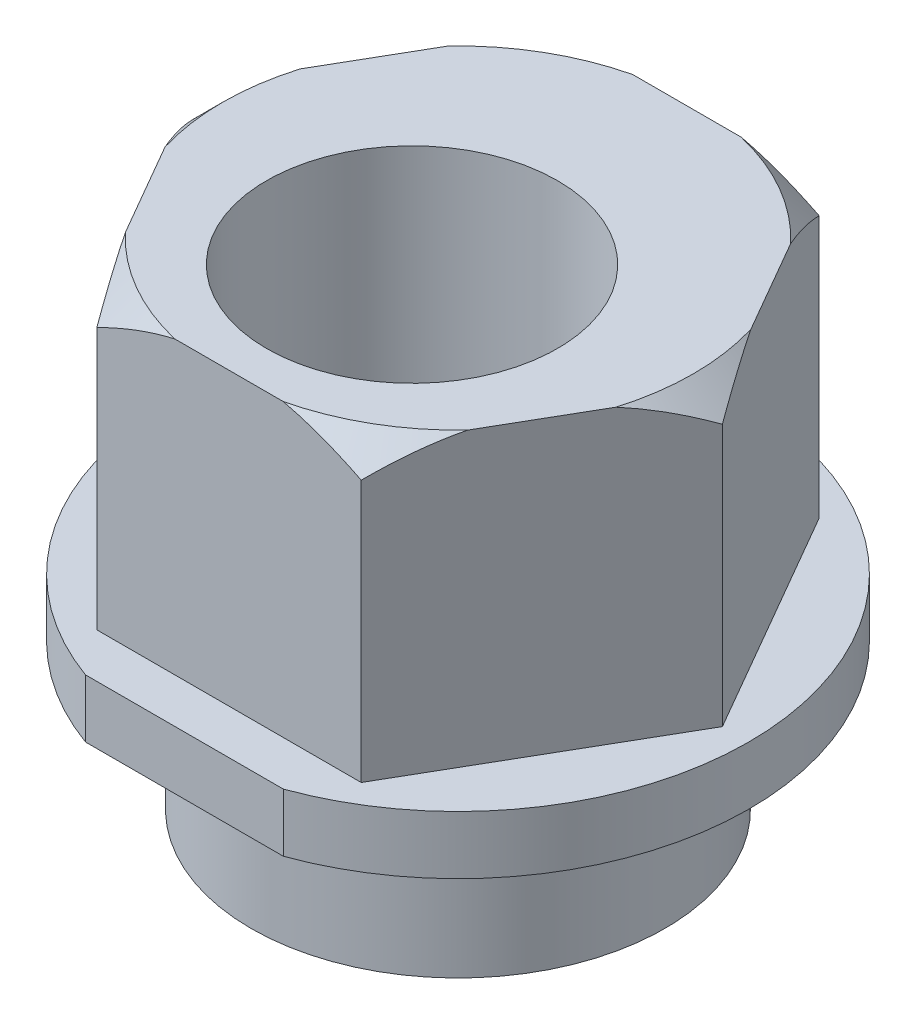
ISO-10303-21;
HEADER;
FILE_DESCRIPTION(('STEP AP214'),'2;1');
FILE_NAME('part.step','',(''),(''),'','','');
FILE_SCHEMA(('AUTOMOTIVE_DESIGN { 1 0 10303 214 1 1 1 1 }'));
ENDSEC;
DATA;
#1=APPLICATION_CONTEXT('core data for automotive mechanical design processes');
#2=APPLICATION_PROTOCOL_DEFINITION('international standard','automotive_design',2000,#1);
#3=PRODUCT_CONTEXT('',#1,'mechanical');
#4=PRODUCT('Part','Part','',(#3));
#5=PRODUCT_RELATED_PRODUCT_CATEGORY('part','',(#4));
#6=PRODUCT_DEFINITION_FORMATION('','',#4);
#7=PRODUCT_DEFINITION_CONTEXT('part definition',#1,'design');
#8=PRODUCT_DEFINITION('design','',#6,#7);
#9=PRODUCT_DEFINITION_SHAPE('','',#8);
#10=(LENGTH_UNIT() NAMED_UNIT(*) SI_UNIT(.MILLI.,.METRE.));
#11=(NAMED_UNIT(*) PLANE_ANGLE_UNIT() SI_UNIT($,.RADIAN.));
#12=(NAMED_UNIT(*) SI_UNIT($,.STERADIAN.) SOLID_ANGLE_UNIT());
#13=UNCERTAINTY_MEASURE_WITH_UNIT(LENGTH_MEASURE(1.E-05),#10,'distance_accuracy_value','');
#14=(GEOMETRIC_REPRESENTATION_CONTEXT(3) GLOBAL_UNCERTAINTY_ASSIGNED_CONTEXT((#13)) GLOBAL_UNIT_ASSIGNED_CONTEXT((#10,
#11,#12)) REPRESENTATION_CONTEXT('',''));
#15=CARTESIAN_POINT('',(0.,0.,0.));
#16=DIRECTION('',(0.,0.,1.));
#17=DIRECTION('',(1.,0.,0.));
#18=AXIS2_PLACEMENT_3D('',#15,#16,#17);
#19=CARTESIAN_POINT('',(0.,-1.,0.));
#20=DIRECTION('',(0.,1.,0.));
#21=DIRECTION('',(0.,0.,1.));
#22=AXIS2_PLACEMENT_3D('',#19,#20,#21);
#23=PLANE('',#22);
#24=CARTESIAN_POINT('',(0.,-1.,0.));
#25=DIRECTION('',(0.,1.,0.));
#26=DIRECTION('',(0.,0.,1.));
#27=AXIS2_PLACEMENT_3D('',#24,#25,#26);
#28=CIRCLE('',#27,5.);
#29=CARTESIAN_POINT('',(1.7,-1.,4.7021271782035));
#30=VERTEX_POINT('',#29);
#31=CARTESIAN_POINT('',(-1.7,-1.,4.7021271782035));
#32=VERTEX_POINT('',#31);
#33=EDGE_CURVE('E233',#30,#32,#28,.T.);
#34=ORIENTED_EDGE('',*,*,#33,.F.);
#35=DIRECTION('',(-1.,0.,0.));
#36=VECTOR('',#35,1.);
#37=CARTESIAN_POINT('',(0.,-1.,4.7021271782035));
#38=LINE('',#37,#36);
#39=EDGE_CURVE('E348',#30,#32,#38,.T.);
#40=ORIENTED_EDGE('',*,*,#39,.T.);
#41=EDGE_LOOP('',(#34,#40));
#42=FACE_BOUND('',#41,.T.);
#43=CARTESIAN_POINT('',(0.,-1.,0.));
#44=DIRECTION('',(0.,1.,0.));
#45=DIRECTION('',(0.,0.,1.));
#46=AXIS2_PLACEMENT_3D('',#43,#44,#45);
#47=CIRCLE('',#46,3.555);
#48=CARTESIAN_POINT('',(0.,-1.,3.555));
#49=VERTEX_POINT('',#48);
#50=EDGE_CURVE('E178',#49,#49,#47,.F.);
#51=ORIENTED_EDGE('',*,*,#50,.F.);
#52=EDGE_LOOP('',(#51));
#53=FACE_BOUND('',#52,.T.);
#54=ADVANCED_FACE('F46',(#42,#53),#23,.F.);
#55=CARTESIAN_POINT('',(2.27187330926118,5.,3.935));
#56=DIRECTION('',(-0.866025403784439,0.,-0.5));
#57=DIRECTION('',(-0.5,0.,0.866025403784439));
#58=AXIS2_PLACEMENT_3D('',#55,#56,#57);
#59=PLANE('',#58);
#60=DIRECTION('',(0.,-1.,0.));
#61=VECTOR('',#60,1.);
#62=CARTESIAN_POINT('',(4.54374661852235,5.,0.));
#63=LINE('',#62,#61);
#64=CARTESIAN_POINT('',(4.54374661852235,4.5,0.));
#65=VERTEX_POINT('',#64);
#66=CARTESIAN_POINT('',(4.54374661852235,0.,0.));
#67=VERTEX_POINT('',#66);
#68=EDGE_CURVE('E175',#65,#67,#63,.T.);
#69=ORIENTED_EDGE('',*,*,#68,.F.);
#70=CARTESIAN_POINT('',(6.12736327266163,2.33046829888115,-2.74290450468147));
#71=CARTESIAN_POINT('',(6.07348339276709,2.4177650828994,-2.64958181519841));
#72=CARTESIAN_POINT('',(6.01938921555573,2.50453762285222,-2.55588795187471));
#73=CARTESIAN_POINT('',(5.91069789973588,2.67683309661582,-2.36762907053321));
#74=CARTESIAN_POINT('',(5.85610071578471,2.76235591593962,-2.27306397397959));
#75=CARTESIAN_POINT('',(5.74620735938589,2.9321379387506,-2.08272309728255));
#76=CARTESIAN_POINT('',(5.6909098259844,3.01639362513631,-1.98694495989795));
#77=CARTESIAN_POINT('',(5.57966030231228,3.18315508159383,-1.79425513258));
#78=CARTESIAN_POINT('',(5.52370832991605,3.26566089928668,-1.69734347360602));
#79=CARTESIAN_POINT('',(5.40948255505868,3.43085092459455,-1.49949862801914));
#80=CARTESIAN_POINT('',(5.3511874452437,3.51347634106705,-1.3985285359868));
#81=CARTESIAN_POINT('',(5.23367321649109,3.67605365317037,-1.194987921175));
#82=CARTESIAN_POINT('',(5.17445413325307,3.75600565172091,-1.09241746022911));
#83=CARTESIAN_POINT('',(5.05499257757878,3.9125743398257,-0.885503976250002));
#84=CARTESIAN_POINT('',(4.99475102957391,3.98919384008597,-0.78116255437897));
#85=CARTESIAN_POINT('',(4.873034492307,4.1383918042904,-0.570343327711337));
#86=CARTESIAN_POINT('',(4.81155966257741,4.21097078637303,-0.463865799233039));
#87=CARTESIAN_POINT('',(4.68581480841085,4.35265115676022,-0.246069323026223));
#88=CARTESIAN_POINT('',(4.62151303943029,4.42164059850529,-0.134695392135335));
#89=CARTESIAN_POINT('',(4.4912183922476,4.55301635986169,0.090981556739347));
#90=CARTESIAN_POINT('',(4.42522527529575,4.61540174079966,0.205284988249787));
#91=CARTESIAN_POINT('',(4.29176890522431,4.73150823576122,0.436438201807242));
#92=CARTESIAN_POINT('',(4.22431561588303,4.78527468558276,0.553270726083977));
#93=CARTESIAN_POINT('',(4.08756303909753,4.88247623364584,0.790133137142428));
#94=CARTESIAN_POINT('',(4.01826431274338,4.92591443311341,0.910162052087628));
#95=CARTESIAN_POINT('',(3.89160680975576,4.99299560676046,1.129539282422));
#96=CARTESIAN_POINT('',(3.83454175212893,5.01884439579798,1.22837886156851));
#97=CARTESIAN_POINT('',(3.71955042243969,5.06126068823275,1.42754968702018));
#98=CARTESIAN_POINT('',(3.66162427680432,5.0778295405829,1.52788071434728));
#99=CARTESIAN_POINT('',(3.54536540774452,5.10083438466152,1.72924698238935));
#100=CARTESIAN_POINT('',(3.4870335640049,5.1072879053957,1.83028069944554));
#101=CARTESIAN_POINT('',(3.37031281221754,5.10976287991731,2.03244697183888));
#102=CARTESIAN_POINT('',(3.31192390350574,5.10578421082689,2.13357952832621));
#103=CARTESIAN_POINT('',(3.19571069696838,5.08764038060559,2.33486670655941));
#104=CARTESIAN_POINT('',(3.13788528988516,5.07350318473267,2.43502324959591));
#105=CARTESIAN_POINT('',(3.02300572590152,5.03579603444199,2.63400049116693));
#106=CARTESIAN_POINT('',(2.96595175572664,5.01222383709666,2.73282086628335));
#107=CARTESIAN_POINT('',(2.85271904802042,4.95661618256865,2.9289456691091));
#108=CARTESIAN_POINT('',(2.79654337792266,4.92455603960202,3.02624478386765));
#109=CARTESIAN_POINT('',(2.68537248742994,4.85318593152667,3.21879841452373));
#110=CARTESIAN_POINT('',(2.63037720983353,4.81387631861451,3.31405302949706));
#111=CARTESIAN_POINT('',(2.5019161833033,4.71383121159169,3.53655405423988));
#112=CARTESIAN_POINT('',(2.42896022795634,4.65048731772351,3.66291747561553));
#113=CARTESIAN_POINT('',(2.28511505424096,4.51496245516658,3.91206462491415));
#114=CARTESIAN_POINT('',(2.2142269607044,4.44277678394606,4.03484640457117));
#115=CARTESIAN_POINT('',(2.07416708594693,4.29140781010891,4.27743722375284));
#116=CARTESIAN_POINT('',(2.00499919286836,4.21221022636325,4.39723952881742));
#117=CARTESIAN_POINT('',(1.86828970424628,4.04847541244671,4.63402730898762));
#118=CARTESIAN_POINT('',(1.80074782327538,3.96393912900212,4.75101327846797));
#119=CARTESIAN_POINT('',(1.6667324101583,3.790255628053,4.9831347829841));
#120=CARTESIAN_POINT('',(1.60026513983173,3.70108917509827,5.09825947223014));
#121=CARTESIAN_POINT('',(1.46849790545969,3.51936003005431,5.32648701693534));
#122=CARTESIAN_POINT('',(1.40319803917282,3.42679705550268,5.43958970307165));
#123=CARTESIAN_POINT('',(1.27366225353528,3.23904020589262,5.66395226519422));
#124=CARTESIAN_POINT('',(1.20942525212282,3.14384930831284,5.77521401536649));
#125=CARTESIAN_POINT('',(1.08179181966025,2.9512386314917,5.99628160513605));
#126=CARTESIAN_POINT('',(1.01839540535985,2.85381880794148,6.10608741572204));
#127=CARTESIAN_POINT('',(0.910409016945997,2.6853578347565,6.2931253269807));
#128=CARTESIAN_POINT('',(0.865642352807006,2.61476846228915,6.3706634637548));
#129=CARTESIAN_POINT('',(0.776622094234247,2.47305833440251,6.52485107450574));
#130=CARTESIAN_POINT('',(0.732367142810404,2.40194099006958,6.60150289885833));
#131=CARTESIAN_POINT('',(0.688256655121896,2.33046829888115,6.67790450468147));
#132=B_SPLINE_CURVE_WITH_KNOTS('',3,(#70,#71,#72,#73,#74,#75,#76,#77,#78,#79,#80,#81,#82,#83,
#84,#85,#86,#87,#88,#89,#90,#91,#92,#93,#94,#95,#96,#97,#98,#99,#100,#101,#102,#103,#104,#105,
#106,#107,#108,#109,#110,#111,#112,#113,#114,#115,#116,#117,#118,#119,#120,#121,#122,#123,#124,
#125,#126,#127,#128,#129,#130,#131),.UNSPECIFIED.,.F.,.F.,(4,2,2,2,2,2,2,2,2,2,2,2,2,2,2,2,2,2,
2,2,2,2,2,2,2,2,2,2,2,2,4),(0.,0.416050988652375,0.832139855784054,1.24922530063749,
1.6662993802975,2.09496685038955,2.52361779884089,2.95189991005181,3.38012697311563,
3.81779500231414,4.25552515650994,4.69087140580247,5.12608676971888,5.4768138337239,
5.82748990199696,6.17755760407587,6.52762942952254,6.87674122143841,7.22593605499141,
7.5761578380004,7.92636261087879,8.40316579002672,8.88022366888807,9.35827656071276,
9.83624491486482,10.316388748245,10.7965726023688,11.2762330860941,11.7559031133002,
12.0979389750605,12.4385584137849),.UNSPECIFIED.);
#133=CARTESIAN_POINT('',(3.87355176865353,5.,1.1608115309438));
#134=VERTEX_POINT('',#133);
#135=EDGE_CURVE('E325',#65,#134,#132,.T.);
#136=ORIENTED_EDGE('',*,*,#135,.T.);
#137=DIRECTION('',(0.5,0.,-0.866025403784439));
#138=VECTOR('',#137,1.);
#139=CARTESIAN_POINT('',(2.27187330926118,5.,3.935));
#140=LINE('',#139,#138);
#141=CARTESIAN_POINT('',(2.94206815913,5.,2.7741884690562));
#142=VERTEX_POINT('',#141);
#143=EDGE_CURVE('E245',#142,#134,#140,.T.);
#144=ORIENTED_EDGE('',*,*,#143,.F.);
#145=CARTESIAN_POINT('',(2.27187330926118,4.5,3.935));
#146=VERTEX_POINT('',#145);
#147=EDGE_CURVE('E262',#142,#146,#132,.T.);
#148=ORIENTED_EDGE('',*,*,#147,.T.);
#149=DIRECTION('',(0.,-1.,0.));
#150=VECTOR('',#149,1.);
#151=CARTESIAN_POINT('',(2.27187330926118,5.,3.935));
#152=LINE('',#151,#150);
#153=CARTESIAN_POINT('',(2.27187330926118,0.,3.935));
#154=VERTEX_POINT('',#153);
#155=EDGE_CURVE('E229',#146,#154,#152,.T.);
#156=ORIENTED_EDGE('',*,*,#155,.T.);
#157=DIRECTION('',(0.5,0.,-0.866025403784439));
#158=VECTOR('',#157,1.);
#159=CARTESIAN_POINT('',(2.27187330926118,0.,3.935));
#160=LINE('',#159,#158);
#161=EDGE_CURVE('E230',#154,#67,#160,.T.);
#162=ORIENTED_EDGE('',*,*,#161,.T.);
#163=EDGE_LOOP('',(#69,#136,#144,#148,#156,#162));
#164=FACE_BOUND('',#163,.T.);
#165=ADVANCED_FACE('F48',(#164),#59,.F.);
#166=CARTESIAN_POINT('',(4.54374661852235,5.,0.));
#167=DIRECTION('',(-0.866025403784438,0.,0.5));
#168=DIRECTION('',(0.5,0.,0.866025403784438));
#169=AXIS2_PLACEMENT_3D('',#166,#167,#168);
#170=PLANE('',#169);
#171=DIRECTION('',(0.,-1.,0.));
#172=VECTOR('',#171,1.);
#173=CARTESIAN_POINT('',(2.27187330926118,5.,-3.935));
#174=LINE('',#173,#172);
#175=CARTESIAN_POINT('',(2.27187330926118,4.5,-3.935));
#176=VERTEX_POINT('',#175);
#177=CARTESIAN_POINT('',(2.27187330926118,0.,-3.935));
#178=VERTEX_POINT('',#177);
#179=EDGE_CURVE('E164',#176,#178,#174,.T.);
#180=ORIENTED_EDGE('',*,*,#179,.F.);
#181=CARTESIAN_POINT('',(0.688256655121894,2.33046829888116,-6.67790450468146));
#182=CARTESIAN_POINT('',(0.742136535016436,2.4177650828994,-6.58458181519841));
#183=CARTESIAN_POINT('',(0.796230712227795,2.50453762285222,-6.4908879518747));
#184=CARTESIAN_POINT('',(0.904922028047648,2.67683309661582,-6.3026290705332));
#185=CARTESIAN_POINT('',(0.959519211998818,2.76235591593963,-6.20806397397959));
#186=CARTESIAN_POINT('',(1.06941256839764,2.93213793875061,-6.01772309728255));
#187=CARTESIAN_POINT('',(1.12471010179913,3.01639362513632,-5.92194495989794));
#188=CARTESIAN_POINT('',(1.23595962547125,3.18315508159383,-5.72925513257999));
#189=CARTESIAN_POINT('',(1.29191159786749,3.26566089928668,-5.63234347360602));
#190=CARTESIAN_POINT('',(1.40613737272485,3.43085092459456,-5.43449862801913));
#191=CARTESIAN_POINT('',(1.46443248253983,3.51347634106706,-5.33352853598679));
#192=CARTESIAN_POINT('',(1.58194671129244,3.67605365317038,-5.12998792117499));
#193=CARTESIAN_POINT('',(1.64116579453046,3.75600565172092,-5.0274174602291));
#194=CARTESIAN_POINT('',(1.76062735020476,3.9125743398257,-4.82050397624999));
#195=CARTESIAN_POINT('',(1.82086889820963,3.98919384008598,-4.71616255437896));
#196=CARTESIAN_POINT('',(1.94258543547653,4.1383918042904,-4.50534332771133));
#197=CARTESIAN_POINT('',(2.00406026520612,4.21097078637303,-4.39886579923303));
#198=CARTESIAN_POINT('',(2.12980511937268,4.35265115676022,-4.18106932302621));
#199=CARTESIAN_POINT('',(2.19410688835324,4.4216405985053,-4.06969539213533));
#200=CARTESIAN_POINT('',(2.32440153553593,4.5530163598617,-3.84401844326064));
#201=CARTESIAN_POINT('',(2.39039465248778,4.61540174079966,-3.7297150117502));
#202=CARTESIAN_POINT('',(2.52385102255923,4.73150823576123,-3.49856179819275));
#203=CARTESIAN_POINT('',(2.5913043119005,4.78527468558276,-3.38172927391602));
#204=CARTESIAN_POINT('',(2.728056888686,4.88247623364584,-3.14486686285757));
#205=CARTESIAN_POINT('',(2.79735561504015,4.92591443311342,-3.02483794791237));
#206=CARTESIAN_POINT('',(2.92401311802778,4.99299560676046,-2.805460717578));
#207=CARTESIAN_POINT('',(2.98107817565461,5.01884439579799,-2.70662113843148));
#208=CARTESIAN_POINT('',(3.09606950534385,5.06126068823276,-2.50745031297981));
#209=CARTESIAN_POINT('',(3.15399565097922,5.0778295405829,-2.40711928565272));
#210=CARTESIAN_POINT('',(3.27025452003902,5.10083438466152,-2.20575301761065));
#211=CARTESIAN_POINT('',(3.32858636377864,5.1072879053957,-2.10471930055446));
#212=CARTESIAN_POINT('',(3.445307115566,5.10976287991731,-1.90255302816112));
#213=CARTESIAN_POINT('',(3.50369602427779,5.10578421082689,-1.80142047167379));
#214=CARTESIAN_POINT('',(3.61990923081515,5.08764038060559,-1.60013329344058));
#215=CARTESIAN_POINT('',(3.67773463789837,5.07350318473267,-1.49997675040409));
#216=CARTESIAN_POINT('',(3.79261420188202,5.03579603444199,-1.30099950883306));
#217=CARTESIAN_POINT('',(3.8496681720569,5.01222383709666,-1.20217913371665));
#218=CARTESIAN_POINT('',(3.96290087976311,4.95661618256865,-1.00605433089089));
#219=CARTESIAN_POINT('',(4.01907654986087,4.92455603960202,-0.908755216132345));
#220=CARTESIAN_POINT('',(4.13024744035359,4.85318593152667,-0.716201585476272));
#221=CARTESIAN_POINT('',(4.18524271795,4.81387631861451,-0.620946970502936));
#222=CARTESIAN_POINT('',(4.31370374448024,4.71383121159169,-0.398445945760117));
#223=CARTESIAN_POINT('',(4.38665969982719,4.6504873177235,-0.272082524384468));
#224=CARTESIAN_POINT('',(4.53050487354258,4.51496245516658,-0.0229353750858439));
#225=CARTESIAN_POINT('',(4.60139296707914,4.44277678394605,0.0998464045711766));
#226=CARTESIAN_POINT('',(4.74145284183661,4.2914078101089,0.342437223752842));
#227=CARTESIAN_POINT('',(4.81062073491518,4.21221022636324,0.462239528817422));
#228=CARTESIAN_POINT('',(4.94733022353726,4.0484754124467,0.699027308987622));
#229=CARTESIAN_POINT('',(5.01487210450815,3.96393912900211,0.81601327846798));
#230=CARTESIAN_POINT('',(5.14888751762524,3.79025562805299,1.04813478298411));
#231=CARTESIAN_POINT('',(5.21535478795181,3.70108917509827,1.16325947223014));
#232=CARTESIAN_POINT('',(5.34712202232385,3.5193600300543,1.39148701693534));
#233=CARTESIAN_POINT('',(5.41242188861072,3.42679705550267,1.50458970307166));
#234=CARTESIAN_POINT('',(5.54195767424825,3.23904020589262,1.72895226519422));
#235=CARTESIAN_POINT('',(5.60619467566072,3.14384930831283,1.84021401536649));
#236=CARTESIAN_POINT('',(5.73382810812329,2.95123863149169,2.06128160513606));
#237=CARTESIAN_POINT('',(5.79722452242369,2.85381880794147,2.17108741572204));
#238=CARTESIAN_POINT('',(5.90521091083754,2.68535783475649,2.3581253269807));
#239=CARTESIAN_POINT('',(5.94997757497653,2.61476846228915,2.43566346375481));
#240=CARTESIAN_POINT('',(6.03899783354929,2.47305833440251,2.58985107450574));
#241=CARTESIAN_POINT('',(6.08325278497313,2.40194099006958,2.66650289885833));
#242=CARTESIAN_POINT('',(6.12736327266164,2.33046829888115,2.74290450468146));
#243=B_SPLINE_CURVE_WITH_KNOTS('',3,(#181,#182,#183,#184,#185,#186,#187,#188,#189,#190,#191,
#192,#193,#194,#195,#196,#197,#198,#199,#200,#201,#202,#203,#204,#205,#206,#207,#208,#209,#210,
#211,#212,#213,#214,#215,#216,#217,#218,#219,#220,#221,#222,#223,#224,#225,#226,#227,#228,#229,
#230,#231,#232,#233,#234,#235,#236,#237,#238,#239,#240,#241,#242),.UNSPECIFIED.,.F.,.F.,(4,2,2,
2,2,2,2,2,2,2,2,2,2,2,2,2,2,2,2,2,2,2,2,2,2,2,2,2,2,2,4),(0.,0.416050988652376,
0.832139855784055,1.24922530063749,1.66629938029751,2.09496685038956,2.5236177988409,
2.95189991005182,3.38012697311563,3.81779500231415,4.25552515650994,4.69087140580247,
5.12608676971889,5.4768138337239,5.82748990199696,6.17755760407587,6.52762942952254,
6.87674122143841,7.22593605499141,7.57615783800039,7.92636261087879,8.40316579002672,
8.88022366888807,9.35827656071276,9.83624491486482,10.316388748245,10.7965726023688,
11.2762330860941,11.7559031133002,12.0979389750605,12.4385584137849),.UNSPECIFIED.);
#244=CARTESIAN_POINT('',(2.94206815913,5.,-2.7741884690562));
#245=VERTEX_POINT('',#244);
#246=EDGE_CURVE('E147',#176,#245,#243,.T.);
#247=ORIENTED_EDGE('',*,*,#246,.T.);
#248=DIRECTION('',(-0.5,0.,-0.866025403784438));
#249=VECTOR('',#248,1.);
#250=CARTESIAN_POINT('',(4.54374661852235,5.,0.));
#251=LINE('',#250,#249);
#252=CARTESIAN_POINT('',(3.87355176865353,5.,-1.1608115309438));
#253=VERTEX_POINT('',#252);
#254=EDGE_CURVE('E223',#253,#245,#251,.T.);
#255=ORIENTED_EDGE('',*,*,#254,.F.);
#256=EDGE_CURVE('E157',#253,#65,#243,.T.);
#257=ORIENTED_EDGE('',*,*,#256,.T.);
#258=ORIENTED_EDGE('',*,*,#68,.T.);
#259=DIRECTION('',(-0.5,0.,-0.866025403784438));
#260=VECTOR('',#259,1.);
#261=CARTESIAN_POINT('',(4.54374661852235,0.,0.));
#262=LINE('',#261,#260);
#263=EDGE_CURVE('E174',#67,#178,#262,.T.);
#264=ORIENTED_EDGE('',*,*,#263,.T.);
#265=EDGE_LOOP('',(#180,#247,#255,#257,#258,#264));
#266=FACE_BOUND('',#265,.T.);
#267=ADVANCED_FACE('F172',(#266),#170,.F.);
#268=CARTESIAN_POINT('',(2.27187330926118,5.,-3.935));
#269=DIRECTION('',(0.,0.,1.));
#270=DIRECTION('',(1.,0.,0.));
#271=AXIS2_PLACEMENT_3D('',#268,#269,#270);
#272=PLANE('',#271);
#273=DIRECTION('',(0.,-1.,0.));
#274=VECTOR('',#273,1.);
#275=CARTESIAN_POINT('',(-2.27187330926118,5.,-3.935));
#276=LINE('',#275,#274);
#277=CARTESIAN_POINT('',(-2.27187330926118,4.5,-3.935));
#278=VERTEX_POINT('',#277);
#279=CARTESIAN_POINT('',(-2.27187330926118,0.,-3.935));
#280=VERTEX_POINT('',#279);
#281=EDGE_CURVE('E176',#278,#280,#276,.T.);
#282=ORIENTED_EDGE('',*,*,#281,.F.);
#283=CARTESIAN_POINT('',(-5.01477781394264,2.6694057488158,-3.935));
#284=CARTESIAN_POINT('',(-4.90228240032233,2.75789162999437,-3.935));
#285=CARTESIAN_POINT('',(-4.78924605492269,2.84569863662638,-3.935));
#286=CARTESIAN_POINT('',(-4.56188241632701,3.01966288534844,-3.935));
#287=CARTESIAN_POINT('',(-4.44755491307628,3.10581985266844,-3.935));
#288=CARTESIAN_POINT('',(-4.21685222046402,3.27659538663721,-3.935));
#289=CARTESIAN_POINT('',(-4.10046957789372,3.36120391114583,-3.935));
#290=CARTESIAN_POINT('',(-3.86599418351296,3.52801066974508,-3.935));
#291=CARTESIAN_POINT('',(-3.74790151420127,3.61020901953759,-3.935));
#292=CARTESIAN_POINT('',(-3.50380543280417,3.77568927594522,-3.935));
#293=CARTESIAN_POINT('',(-3.3777005297054,3.85882204730453,-3.935));
#294=CARTESIAN_POINT('',(-3.12293409141574,4.0210686075328,-3.935));
#295=CARTESIAN_POINT('',(-2.99427277147477,4.10018273279293,-3.935));
#296=CARTESIAN_POINT('',(-2.7342134500717,4.25322326602883,-3.935));
#297=CARTESIAN_POINT('',(-2.60282112402671,4.32715926211431,-3.935));
#298=CARTESIAN_POINT('',(-2.33665993470769,4.46865096658867,-3.935));
#299=CARTESIAN_POINT('',(-2.20189200633557,4.53620841737975,-3.935));
#300=CARTESIAN_POINT('',(-1.94277039794665,4.65662539379787,-3.935));
#301=CARTESIAN_POINT('',(-1.81879024517606,4.7102827638368,-3.935));
#302=CARTESIAN_POINT('',(-1.56760322182998,4.80956431437058,-3.935));
#303=CARTESIAN_POINT('',(-1.4403960426367,4.8551877231961,-3.935));
#304=CARTESIAN_POINT('',(-1.18430895439847,4.93616339546024,-3.935));
#305=CARTESIAN_POINT('',(-1.05546474171029,4.97162701315895,-3.935));
#306=CARTESIAN_POINT('',(-0.795188728182397,5.03120060018271,-3.935));
#307=CARTESIAN_POINT('',(-0.663757985336443,5.05531511515621,-3.935));
#308=CARTESIAN_POINT('',(-0.39667530812576,5.09105643721047,-3.935));
#309=CARTESIAN_POINT('',(-0.260990364554486,5.10244193256667,-3.935));
#310=CARTESIAN_POINT('',(0.0108256286758382,5.11107629854814,-3.935));
#311=CARTESIAN_POINT('',(0.146956639108313,5.10832638056083,-3.935));
#312=CARTESIAN_POINT('',(0.418619878870053,5.08887050209526,-3.935));
#313=CARTESIAN_POINT('',(0.554148970208934,5.0721215602934,-3.935));
#314=CARTESIAN_POINT('',(0.822982454746628,5.02579152850102,-3.935));
#315=CARTESIAN_POINT('',(0.956286242224141,4.99620700199297,-3.935));
#316=CARTESIAN_POINT('',(1.26105655280132,4.91498323631563,-3.935));
#317=CARTESIAN_POINT('',(1.43144793684183,4.85934235740488,-3.935));
#318=CARTESIAN_POINT('',(1.76659971199313,4.73318715507506,-3.935));
#319=CARTESIAN_POINT('',(1.93135663408204,4.66266385383244,-3.935));
#320=CARTESIAN_POINT('',(2.25670464302017,4.50985567629177,-3.935));
#321=CARTESIAN_POINT('',(2.41725700907644,4.42748946751823,-3.935));
#322=CARTESIAN_POINT('',(2.7335996666453,4.25424890954647,-3.935));
#323=CARTESIAN_POINT('',(2.88939106725242,4.16337656225559,-3.935));
#324=CARTESIAN_POINT('',(3.2171018287942,3.96289685347115,-3.935));
#325=CARTESIAN_POINT('',(3.38846902004868,3.85239290462363,-3.935));
#326=CARTESIAN_POINT('',(3.7271209143155,3.62526903861077,-3.935));
#327=CARTESIAN_POINT('',(3.89440474117752,3.50864782550207,-3.935));
#328=CARTESIAN_POINT('',(4.22200861608271,3.27340163426143,-3.935));
#329=CARTESIAN_POINT('',(4.38240091884256,3.15487687320021,-3.935));
#330=CARTESIAN_POINT('',(4.6209837589724,2.97456068361506,-3.935));
#331=CARTESIAN_POINT('',(4.70015123515769,2.91405422097405,-3.935));
#332=CARTESIAN_POINT('',(4.85789331048121,2.79227931530866,-3.935));
#333=CARTESIAN_POINT('',(4.93646793238964,2.73101090179094,-3.935));
#334=CARTESIAN_POINT('',(5.01477781394264,2.6694057488158,-3.935));
#335=B_SPLINE_CURVE_WITH_KNOTS('',3,(#283,#284,#285,#286,#287,#288,#289,#290,#291,#292,#293,
#294,#295,#296,#297,#298,#299,#300,#301,#302,#303,#304,#305,#306,#307,#308,#309,#310,#311,#312,
#313,#314,#315,#316,#317,#318,#319,#320,#321,#322,#323,#324,#325,#326,#327,#328,#329,#330,#331,
#332,#333,#334),.UNSPECIFIED.,.F.,.F.,(4,2,2,2,2,2,2,2,2,2,2,2,2,2,2,2,2,2,2,2,2,2,2,2,2,4),(0.,
0.429382623340998,0.858836137877717,1.29047192805164,1.72208696325132,2.17515026344406,
2.62817557609088,3.08033856015113,3.53237766908385,3.9374314291705,4.34252407384557,
4.74299021725164,5.14329582542998,5.55106798246257,5.95880519450876,6.36779890408527,
6.77690218266532,7.31369645202257,7.85081547305105,8.39181700182992,8.932691525285,
9.54423171138721,10.15590197977,10.7541421331558,11.0530644250241,11.35197517691),.UNSPECIFIED.);
#336=CARTESIAN_POINT('',(-0.931483609523527,5.,-3.935));
#337=VERTEX_POINT('',#336);
#338=EDGE_CURVE('E169',#278,#337,#335,.T.);
#339=ORIENTED_EDGE('',*,*,#338,.T.);
#340=DIRECTION('',(-1.,0.,0.));
#341=VECTOR('',#340,1.);
#342=CARTESIAN_POINT('',(2.27187330926118,5.,-3.935));
#343=LINE('',#342,#341);
#344=CARTESIAN_POINT('',(0.931483609523526,5.,-3.935));
#345=VERTEX_POINT('',#344);
#346=EDGE_CURVE('E168',#345,#337,#343,.T.);
#347=ORIENTED_EDGE('',*,*,#346,.F.);
#348=EDGE_CURVE('E150',#345,#176,#335,.T.);
#349=ORIENTED_EDGE('',*,*,#348,.T.);
#350=ORIENTED_EDGE('',*,*,#179,.T.);
#351=DIRECTION('',(-1.,0.,0.));
#352=VECTOR('',#351,1.);
#353=CARTESIAN_POINT('',(2.27187330926118,0.,-3.935));
#354=LINE('',#353,#352);
#355=EDGE_CURVE('E235',#178,#280,#354,.T.);
#356=ORIENTED_EDGE('',*,*,#355,.T.);
#357=EDGE_LOOP('',(#282,#339,#347,#349,#350,#356));
#358=FACE_BOUND('',#357,.T.);
#359=ADVANCED_FACE('F162',(#358),#272,.F.);
#360=CARTESIAN_POINT('',(-2.27187330926118,5.,-3.935));
#361=DIRECTION('',(0.866025403784438,0.,0.5));
#362=DIRECTION('',(0.5,0.,-0.866025403784439));
#363=AXIS2_PLACEMENT_3D('',#360,#361,#362);
#364=PLANE('',#363);
#365=DIRECTION('',(0.,-1.,0.));
#366=VECTOR('',#365,1.);
#367=CARTESIAN_POINT('',(-4.54374661852235,5.,0.));
#368=LINE('',#367,#366);
#369=CARTESIAN_POINT('',(-4.54374661852235,4.5,0.));
#370=VERTEX_POINT('',#369);
#371=CARTESIAN_POINT('',(-4.54374661852235,0.,0.));
#372=VERTEX_POINT('',#371);
#373=EDGE_CURVE('E180',#370,#372,#368,.T.);
#374=ORIENTED_EDGE('',*,*,#373,.F.);
#375=CARTESIAN_POINT('',(-6.12736327266164,2.33046829888115,2.74290450468147));
#376=CARTESIAN_POINT('',(-6.07348339276709,2.4177650828994,2.64958181519841));
#377=CARTESIAN_POINT('',(-6.01938921555574,2.50453762285222,2.5558879518747));
#378=CARTESIAN_POINT('',(-5.91069789973588,2.67683309661582,2.3676290705332));
#379=CARTESIAN_POINT('',(-5.85610071578471,2.76235591593963,2.27306397397959));
#380=CARTESIAN_POINT('',(-5.74620735938589,2.9321379387506,2.08272309728255));
#381=CARTESIAN_POINT('',(-5.6909098259844,3.01639362513631,1.98694495989795));
#382=CARTESIAN_POINT('',(-5.57966030231228,3.18315508159383,1.79425513257999));
#383=CARTESIAN_POINT('',(-5.52370832991604,3.26566089928668,1.69734347360602));
#384=CARTESIAN_POINT('',(-5.40948255505868,3.43085092459455,1.49949862801913));
#385=CARTESIAN_POINT('',(-5.3511874452437,3.51347634106705,1.39852853598679));
#386=CARTESIAN_POINT('',(-5.23367321649109,3.67605365317037,1.19498792117499));
#387=CARTESIAN_POINT('',(-5.17445413325307,3.75600565172092,1.0924174602291));
#388=CARTESIAN_POINT('',(-5.05499257757878,3.9125743398257,0.885503976249998));
#389=CARTESIAN_POINT('',(-4.99475102957391,3.98919384008598,0.781162554378965));
#390=CARTESIAN_POINT('',(-4.873034492307,4.1383918042904,0.570343327711332));
#391=CARTESIAN_POINT('',(-4.81155966257741,4.21097078637303,0.463865799233036));
#392=CARTESIAN_POINT('',(-4.68581480841085,4.35265115676022,0.24606932302622));
#393=CARTESIAN_POINT('',(-4.62151303943029,4.42164059850529,0.134695392135332));
#394=CARTESIAN_POINT('',(-4.4912183922476,4.55301635986169,-0.0909815567393509));
#395=CARTESIAN_POINT('',(-4.42522527529575,4.61540174079966,-0.205284988249791));
#396=CARTESIAN_POINT('',(-4.2917689052243,4.73150823576122,-0.436438201807246));
#397=CARTESIAN_POINT('',(-4.22431561588303,4.78527468558276,-0.553270726083981));
#398=CARTESIAN_POINT('',(-4.08756303909753,4.88247623364584,-0.790133137142432));
#399=CARTESIAN_POINT('',(-4.01826431274338,4.92591443311341,-0.910162052087631));
#400=CARTESIAN_POINT('',(-3.89160680975576,4.99299560676046,-1.129539282422));
#401=CARTESIAN_POINT('',(-3.83454175212893,5.01884439579798,-1.22837886156851));
#402=CARTESIAN_POINT('',(-3.71955042243968,5.06126068823275,-1.42754968702018));
#403=CARTESIAN_POINT('',(-3.66162427680432,5.0778295405829,-1.52788071434728));
#404=CARTESIAN_POINT('',(-3.54536540774451,5.10083438466152,-1.72924698238935));
#405=CARTESIAN_POINT('',(-3.48703356400489,5.1072879053957,-1.83028069944554));
#406=CARTESIAN_POINT('',(-3.37031281221754,5.10976287991731,-2.03244697183888));
#407=CARTESIAN_POINT('',(-3.31192390350574,5.10578421082689,-2.13357952832621));
#408=CARTESIAN_POINT('',(-3.19571069696838,5.08764038060559,-2.33486670655941));
#409=CARTESIAN_POINT('',(-3.13788528988516,5.07350318473267,-2.43502324959591));
#410=CARTESIAN_POINT('',(-3.02300572590152,5.03579603444199,-2.63400049116693));
#411=CARTESIAN_POINT('',(-2.96595175572664,5.01222383709666,-2.73282086628335));
#412=CARTESIAN_POINT('',(-2.85271904802042,4.95661618256865,-2.9289456691091));
#413=CARTESIAN_POINT('',(-2.79654337792266,4.92455603960202,-3.02624478386765));
#414=CARTESIAN_POINT('',(-2.68537248742994,4.85318593152667,-3.21879841452372));
#415=CARTESIAN_POINT('',(-2.63037720983353,4.81387631861451,-3.31405302949706));
#416=CARTESIAN_POINT('',(-2.5019161833033,4.71383121159169,-3.53655405423988));
#417=CARTESIAN_POINT('',(-2.42896022795634,4.65048731772351,-3.66291747561553));
#418=CARTESIAN_POINT('',(-2.28511505424096,4.51496245516658,-3.91206462491415));
#419=CARTESIAN_POINT('',(-2.21422696070439,4.44277678394606,-4.03484640457117));
#420=CARTESIAN_POINT('',(-2.07416708594693,4.29140781010891,-4.27743722375283));
#421=CARTESIAN_POINT('',(-2.00499919286836,4.21221022636325,-4.39723952881741));
#422=CARTESIAN_POINT('',(-1.86828970424628,4.04847541244671,-4.63402730898761));
#423=CARTESIAN_POINT('',(-1.80074782327538,3.96393912900212,-4.75101327846797));
#424=CARTESIAN_POINT('',(-1.6667324101583,3.790255628053,-4.9831347829841));
#425=CARTESIAN_POINT('',(-1.60026513983173,3.70108917509828,-5.09825947223013));
#426=CARTESIAN_POINT('',(-1.46849790545969,3.51936003005432,-5.32648701693533));
#427=CARTESIAN_POINT('',(-1.40319803917282,3.42679705550269,-5.43958970307165));
#428=CARTESIAN_POINT('',(-1.27366225353529,3.23904020589263,-5.66395226519421));
#429=CARTESIAN_POINT('',(-1.20942525212282,3.14384930831284,-5.77521401536648));
#430=CARTESIAN_POINT('',(-1.08179181966026,2.95123863149171,-5.99628160513604));
#431=CARTESIAN_POINT('',(-1.01839540535985,2.85381880794148,-6.10608741572203));
#432=CARTESIAN_POINT('',(-0.910409016945998,2.68535783475651,-6.29312532698069));
#433=CARTESIAN_POINT('',(-0.865642352807006,2.61476846228916,-6.3706634637548));
#434=CARTESIAN_POINT('',(-0.776622094234247,2.47305833440251,-6.52485107450573));
#435=CARTESIAN_POINT('',(-0.732367142810403,2.40194099006959,-6.60150289885832));
#436=CARTESIAN_POINT('',(-0.688256655121894,2.33046829888116,-6.67790450468146));
#437=B_SPLINE_CURVE_WITH_KNOTS('',3,(#375,#376,#377,#378,#379,#380,#381,#382,#383,#384,#385,
#386,#387,#388,#389,#390,#391,#392,#393,#394,#395,#396,#397,#398,#399,#400,#401,#402,#403,#404,
#405,#406,#407,#408,#409,#410,#411,#412,#413,#414,#415,#416,#417,#418,#419,#420,#421,#422,#423,
#424,#425,#426,#427,#428,#429,#430,#431,#432,#433,#434,#435,#436),.UNSPECIFIED.,.F.,.F.,(4,2,2,
2,2,2,2,2,2,2,2,2,2,2,2,2,2,2,2,2,2,2,2,2,2,2,2,2,2,2,4),(0.,0.416050988652376,
0.832139855784055,1.24922530063749,1.66629938029751,2.09496685038956,2.5236177988409,
2.95189991005181,3.38012697311563,3.81779500231415,4.25552515650994,4.69087140580247,
5.12608676971889,5.4768138337239,5.82748990199696,6.17755760407587,6.52762942952254,
6.87674122143841,7.22593605499141,7.57615783800039,7.92636261087879,8.40316579002672,
8.88022366888806,9.35827656071275,9.83624491486481,10.316388748245,10.7965726023688,
11.276233086094,11.7559031133002,12.0979389750605,12.4385584137849),.UNSPECIFIED.);
#438=CARTESIAN_POINT('',(-3.87355176865353,5.,-1.1608115309438));
#439=VERTEX_POINT('',#438);
#440=EDGE_CURVE('E203',#370,#439,#437,.T.);
#441=ORIENTED_EDGE('',*,*,#440,.T.);
#442=DIRECTION('',(-0.5,0.,0.866025403784439));
#443=VECTOR('',#442,1.);
#444=CARTESIAN_POINT('',(-2.27187330926118,5.,-3.935));
#445=LINE('',#444,#443);
#446=CARTESIAN_POINT('',(-2.94206815913,5.,-2.7741884690562));
#447=VERTEX_POINT('',#446);
#448=EDGE_CURVE('E213',#447,#439,#445,.T.);
#449=ORIENTED_EDGE('',*,*,#448,.F.);
#450=EDGE_CURVE('E215',#447,#278,#437,.T.);
#451=ORIENTED_EDGE('',*,*,#450,.T.);
#452=ORIENTED_EDGE('',*,*,#281,.T.);
#453=DIRECTION('',(-0.5,0.,0.866025403784439));
#454=VECTOR('',#453,1.);
#455=CARTESIAN_POINT('',(-2.27187330926118,0.,-3.935));
#456=LINE('',#455,#454);
#457=EDGE_CURVE('E237',#280,#372,#456,.T.);
#458=ORIENTED_EDGE('',*,*,#457,.T.);
#459=EDGE_LOOP('',(#374,#441,#449,#451,#452,#458));
#460=FACE_BOUND('',#459,.T.);
#461=ADVANCED_FACE('F211',(#460),#364,.F.);
#462=CARTESIAN_POINT('',(-4.54374661852235,5.,0.));
#463=DIRECTION('',(0.866025403784438,0.,-0.5));
#464=DIRECTION('',(-0.5,0.,-0.866025403784439));
#465=AXIS2_PLACEMENT_3D('',#462,#463,#464);
#466=PLANE('',#465);
#467=DIRECTION('',(0.,-1.,0.));
#468=VECTOR('',#467,1.);
#469=CARTESIAN_POINT('',(-2.27187330926118,5.,3.935));
#470=LINE('',#469,#468);
#471=CARTESIAN_POINT('',(-2.27187330926118,4.5,3.935));
#472=VERTEX_POINT('',#471);
#473=CARTESIAN_POINT('',(-2.27187330926118,0.,3.935));
#474=VERTEX_POINT('',#473);
#475=EDGE_CURVE('E247',#472,#474,#470,.T.);
#476=ORIENTED_EDGE('',*,*,#475,.F.);
#477=CARTESIAN_POINT('',(-0.688256655121893,2.33046829888115,6.67790450468147));
#478=CARTESIAN_POINT('',(-0.742136535016436,2.4177650828994,6.58458181519841));
#479=CARTESIAN_POINT('',(-0.796230712227795,2.50453762285222,6.4908879518747));
#480=CARTESIAN_POINT('',(-0.904922028047647,2.67683309661582,6.3026290705332));
#481=CARTESIAN_POINT('',(-0.959519211998818,2.76235591593963,6.20806397397959));
#482=CARTESIAN_POINT('',(-1.06941256839764,2.9321379387506,6.01772309728255));
#483=CARTESIAN_POINT('',(-1.12471010179913,3.01639362513631,5.92194495989795));
#484=CARTESIAN_POINT('',(-1.23595962547125,3.18315508159383,5.72925513257999));
#485=CARTESIAN_POINT('',(-1.29191159786748,3.26566089928668,5.63234347360602));
#486=CARTESIAN_POINT('',(-1.40613737272485,3.43085092459455,5.43449862801913));
#487=CARTESIAN_POINT('',(-1.46443248253983,3.51347634106705,5.33352853598679));
#488=CARTESIAN_POINT('',(-1.58194671129244,3.67605365317037,5.12998792117499));
#489=CARTESIAN_POINT('',(-1.64116579453046,3.75600565172092,5.0274174602291));
#490=CARTESIAN_POINT('',(-1.76062735020475,3.9125743398257,4.82050397625));
#491=CARTESIAN_POINT('',(-1.82086889820962,3.98919384008598,4.71616255437897));
#492=CARTESIAN_POINT('',(-1.94258543547653,4.1383918042904,4.50534332771133));
#493=CARTESIAN_POINT('',(-2.00406026520612,4.21097078637303,4.39886579923304));
#494=CARTESIAN_POINT('',(-2.12980511937268,4.35265115676022,4.18106932302622));
#495=CARTESIAN_POINT('',(-2.19410688835324,4.42164059850529,4.06969539213533));
#496=CARTESIAN_POINT('',(-2.32440153553593,4.55301635986169,3.84401844326065));
#497=CARTESIAN_POINT('',(-2.39039465248778,4.61540174079966,3.72971501175021));
#498=CARTESIAN_POINT('',(-2.52385102255923,4.73150823576122,3.49856179819275));
#499=CARTESIAN_POINT('',(-2.5913043119005,4.78527468558276,3.38172927391602));
#500=CARTESIAN_POINT('',(-2.728056888686,4.88247623364584,3.14486686285757));
#501=CARTESIAN_POINT('',(-2.79735561504015,4.92591443311341,3.02483794791237));
#502=CARTESIAN_POINT('',(-2.92401311802777,4.99299560676046,2.805460717578));
#503=CARTESIAN_POINT('',(-2.9810781756546,5.01884439579798,2.70662113843149));
#504=CARTESIAN_POINT('',(-3.09606950534385,5.06126068823275,2.50745031297982));
#505=CARTESIAN_POINT('',(-3.15399565097921,5.0778295405829,2.40711928565272));
#506=CARTESIAN_POINT('',(-3.27025452003902,5.10083438466152,2.20575301761065));
#507=CARTESIAN_POINT('',(-3.32858636377864,5.1072879053957,2.10471930055446));
#508=CARTESIAN_POINT('',(-3.44530711556599,5.10976287991731,1.90255302816112));
#509=CARTESIAN_POINT('',(-3.50369602427779,5.10578421082689,1.80142047167379));
#510=CARTESIAN_POINT('',(-3.61990923081515,5.08764038060559,1.60013329344058));
#511=CARTESIAN_POINT('',(-3.67773463789837,5.07350318473267,1.49997675040409));
#512=CARTESIAN_POINT('',(-3.79261420188201,5.03579603444199,1.30099950883306));
#513=CARTESIAN_POINT('',(-3.84966817205689,5.01222383709666,1.20217913371665));
#514=CARTESIAN_POINT('',(-3.96290087976311,4.95661618256865,1.0060543308909));
#515=CARTESIAN_POINT('',(-4.01907654986087,4.92455603960202,0.908755216132348));
#516=CARTESIAN_POINT('',(-4.13024744035359,4.85318593152667,0.716201585476275));
#517=CARTESIAN_POINT('',(-4.18524271795,4.81387631861451,0.620946970502938));
#518=CARTESIAN_POINT('',(-4.31370374448024,4.71383121159169,0.39844594576012));
#519=CARTESIAN_POINT('',(-4.38665969982719,4.65048731772351,0.272082524384471));
#520=CARTESIAN_POINT('',(-4.53050487354258,4.51496245516658,0.0229353750858478));
#521=CARTESIAN_POINT('',(-4.60139296707914,4.44277678394605,-0.0998464045711718));
#522=CARTESIAN_POINT('',(-4.7414528418366,4.2914078101089,-0.342437223752836));
#523=CARTESIAN_POINT('',(-4.81062073491518,4.21221022636325,-0.462239528817416));
#524=CARTESIAN_POINT('',(-4.94733022353725,4.04847541244671,-0.699027308987616));
#525=CARTESIAN_POINT('',(-5.01487210450815,3.96393912900212,-0.816013278467974));
#526=CARTESIAN_POINT('',(-5.14888751762524,3.790255628053,-1.0481347829841));
#527=CARTESIAN_POINT('',(-5.21535478795181,3.70108917509827,-1.16325947223014));
#528=CARTESIAN_POINT('',(-5.34712202232384,3.51936003005431,-1.39148701693534));
#529=CARTESIAN_POINT('',(-5.41242188861071,3.42679705550268,-1.50458970307165));
#530=CARTESIAN_POINT('',(-5.54195767424825,3.23904020589263,-1.72895226519421));
#531=CARTESIAN_POINT('',(-5.60619467566072,3.14384930831284,-1.84021401536648));
#532=CARTESIAN_POINT('',(-5.73382810812328,2.9512386314917,-2.06128160513605));
#533=CARTESIAN_POINT('',(-5.79722452242368,2.85381880794148,-2.17108741572204));
#534=CARTESIAN_POINT('',(-5.90521091083754,2.6853578347565,-2.3581253269807));
#535=CARTESIAN_POINT('',(-5.94997757497653,2.61476846228915,-2.4356634637548));
#536=CARTESIAN_POINT('',(-6.03899783354928,2.47305833440251,-2.58985107450574));
#537=CARTESIAN_POINT('',(-6.08325278497313,2.40194099006958,-2.66650289885833));
#538=CARTESIAN_POINT('',(-6.12736327266164,2.33046829888115,-2.74290450468146));
#539=B_SPLINE_CURVE_WITH_KNOTS('',3,(#477,#478,#479,#480,#481,#482,#483,#484,#485,#486,#487,
#488,#489,#490,#491,#492,#493,#494,#495,#496,#497,#498,#499,#500,#501,#502,#503,#504,#505,#506,
#507,#508,#509,#510,#511,#512,#513,#514,#515,#516,#517,#518,#519,#520,#521,#522,#523,#524,#525,
#526,#527,#528,#529,#530,#531,#532,#533,#534,#535,#536,#537,#538),.UNSPECIFIED.,.F.,.F.,(4,2,2,
2,2,2,2,2,2,2,2,2,2,2,2,2,2,2,2,2,2,2,2,2,2,2,2,2,2,2,4),(0.,0.416050988652376,
0.832139855784055,1.24922530063749,1.66629938029751,2.09496685038956,2.5236177988409,
2.95189991005181,3.38012697311563,3.81779500231415,4.25552515650994,4.69087140580247,
5.12608676971889,5.4768138337239,5.82748990199696,6.17755760407587,6.52762942952254,
6.87674122143841,7.22593605499141,7.5761578380004,7.92636261087879,8.40316579002672,
8.88022366888807,9.35827656071275,9.83624491486482,10.316388748245,10.7965726023688,
11.2762330860941,11.7559031133002,12.0979389750605,12.4385584137849),.UNSPECIFIED.);
#540=CARTESIAN_POINT('',(-2.94206815913,5.,2.7741884690562));
#541=VERTEX_POINT('',#540);
#542=EDGE_CURVE('E268',#472,#541,#539,.T.);
#543=ORIENTED_EDGE('',*,*,#542,.T.);
#544=DIRECTION('',(0.5,0.,0.866025403784439));
#545=VECTOR('',#544,1.);
#546=CARTESIAN_POINT('',(-4.54374661852235,5.,0.));
#547=LINE('',#546,#545);
#548=CARTESIAN_POINT('',(-3.87355176865353,5.,1.16081153094381));
#549=VERTEX_POINT('',#548);
#550=EDGE_CURVE('E219',#549,#541,#547,.T.);
#551=ORIENTED_EDGE('',*,*,#550,.F.);
#552=EDGE_CURVE('E70',#549,#370,#539,.T.);
#553=ORIENTED_EDGE('',*,*,#552,.T.);
#554=ORIENTED_EDGE('',*,*,#373,.T.);
#555=DIRECTION('',(0.5,0.,0.866025403784439));
#556=VECTOR('',#555,1.);
#557=CARTESIAN_POINT('',(-4.54374661852235,0.,0.));
#558=LINE('',#557,#556);
#559=EDGE_CURVE('E239',#372,#474,#558,.T.);
#560=ORIENTED_EDGE('',*,*,#559,.T.);
#561=EDGE_LOOP('',(#476,#543,#551,#553,#554,#560));
#562=FACE_BOUND('',#561,.T.);
#563=ADVANCED_FACE('F251',(#562),#466,.F.);
#564=CARTESIAN_POINT('',(-2.27187330926118,5.,3.935));
#565=DIRECTION('',(0.,0.,-1.));
#566=DIRECTION('',(-1.,0.,0.));
#567=AXIS2_PLACEMENT_3D('',#564,#565,#566);
#568=PLANE('',#567);
#569=ORIENTED_EDGE('',*,*,#155,.F.);
#570=CARTESIAN_POINT('',(5.01477781394264,2.6694057488158,3.935));
#571=CARTESIAN_POINT('',(4.90228240032233,2.75789162999437,3.935));
#572=CARTESIAN_POINT('',(4.78924605492269,2.84569863662638,3.935));
#573=CARTESIAN_POINT('',(4.56188241632702,3.01966288534844,3.935));
#574=CARTESIAN_POINT('',(4.44755491307628,3.10581985266844,3.935));
#575=CARTESIAN_POINT('',(4.21685222046402,3.2765953866372,3.935));
#576=CARTESIAN_POINT('',(4.10046957789372,3.36120391114583,3.935));
#577=CARTESIAN_POINT('',(3.86599418351296,3.52801066974507,3.935));
#578=CARTESIAN_POINT('',(3.74790151420128,3.61020901953759,3.935));
#579=CARTESIAN_POINT('',(3.50380543280417,3.77568927594521,3.935));
#580=CARTESIAN_POINT('',(3.3777005297054,3.85882204730453,3.935));
#581=CARTESIAN_POINT('',(3.12293409141574,4.0210686075328,3.935));
#582=CARTESIAN_POINT('',(2.99427277147477,4.10018273279292,3.935));
#583=CARTESIAN_POINT('',(2.73421345007169,4.25322326602883,3.935));
#584=CARTESIAN_POINT('',(2.6028211240267,4.32715926211431,3.935));
#585=CARTESIAN_POINT('',(2.33665993470769,4.46865096658866,3.935));
#586=CARTESIAN_POINT('',(2.20189200633557,4.53620841737975,3.935));
#587=CARTESIAN_POINT('',(1.94277039794665,4.65662539379787,3.935));
#588=CARTESIAN_POINT('',(1.81879024517606,4.7102827638368,3.935));
#589=CARTESIAN_POINT('',(1.56760322182998,4.80956431437058,3.935));
#590=CARTESIAN_POINT('',(1.4403960426367,4.8551877231961,3.935));
#591=CARTESIAN_POINT('',(1.18430895439847,4.93616339546023,3.935));
#592=CARTESIAN_POINT('',(1.05546474171029,4.97162701315895,3.935));
#593=CARTESIAN_POINT('',(0.795188728182395,5.03120060018271,3.935));
#594=CARTESIAN_POINT('',(0.663757985336441,5.05531511515621,3.935));
#595=CARTESIAN_POINT('',(0.396675308125757,5.09105643721046,3.935));
#596=CARTESIAN_POINT('',(0.260990364554484,5.10244193256667,3.935));
#597=CARTESIAN_POINT('',(-0.0108256286758407,5.11107629854814,3.935));
#598=CARTESIAN_POINT('',(-0.146956639108315,5.10832638056083,3.935));
#599=CARTESIAN_POINT('',(-0.418619878870055,5.08887050209526,3.935));
#600=CARTESIAN_POINT('',(-0.554148970208936,5.07212156029339,3.935));
#601=CARTESIAN_POINT('',(-0.82298245474663,5.02579152850101,3.935));
#602=CARTESIAN_POINT('',(-0.956286242224143,4.99620700199297,3.935));
#603=CARTESIAN_POINT('',(-1.26105655280132,4.91498323631563,3.935));
#604=CARTESIAN_POINT('',(-1.43144793684184,4.85934235740488,3.935));
#605=CARTESIAN_POINT('',(-1.76659971199313,4.73318715507506,3.935));
#606=CARTESIAN_POINT('',(-1.93135663408205,4.66266385383244,3.935));
#607=CARTESIAN_POINT('',(-2.25670464302018,4.50985567629176,3.935));
#608=CARTESIAN_POINT('',(-2.41725700907645,4.42748946751823,3.935));
#609=CARTESIAN_POINT('',(-2.73359966664531,4.25424890954647,3.935));
#610=CARTESIAN_POINT('',(-2.88939106725242,4.16337656225559,3.935));
#611=CARTESIAN_POINT('',(-3.2171018287942,3.96289685347115,3.935));
#612=CARTESIAN_POINT('',(-3.38846902004868,3.85239290462363,3.935));
#613=CARTESIAN_POINT('',(-3.7271209143155,3.62526903861077,3.935));
#614=CARTESIAN_POINT('',(-3.89440474117752,3.50864782550207,3.935));
#615=CARTESIAN_POINT('',(-4.22200861608271,3.27340163426143,3.935));
#616=CARTESIAN_POINT('',(-4.38240091884256,3.15487687320021,3.935));
#617=CARTESIAN_POINT('',(-4.6209837589724,2.97456068361506,3.935));
#618=CARTESIAN_POINT('',(-4.70015123515769,2.91405422097405,3.935));
#619=CARTESIAN_POINT('',(-4.85789331048121,2.79227931530866,3.935));
#620=CARTESIAN_POINT('',(-4.93646793238964,2.73101090179094,3.935));
#621=CARTESIAN_POINT('',(-5.01477781394264,2.6694057488158,3.935));
#622=B_SPLINE_CURVE_WITH_KNOTS('',3,(#570,#571,#572,#573,#574,#575,#576,#577,#578,#579,#580,
#581,#582,#583,#584,#585,#586,#587,#588,#589,#590,#591,#592,#593,#594,#595,#596,#597,#598,#599,
#600,#601,#602,#603,#604,#605,#606,#607,#608,#609,#610,#611,#612,#613,#614,#615,#616,#617,#618,
#619,#620,#621),.UNSPECIFIED.,.F.,.F.,(4,2,2,2,2,2,2,2,2,2,2,2,2,2,2,2,2,2,2,2,2,2,2,2,2,4),(0.,
0.429382623340998,0.858836137877717,1.29047192805164,1.72208696325132,2.17515026344406,
2.62817557609088,3.08033856015113,3.53237766908385,3.93743142917051,4.34252407384557,
4.74299021725164,5.14329582542998,5.55106798246258,5.95880519450876,6.36779890408527,
6.77690218266532,7.31369645202258,7.85081547305105,8.39181700182993,8.93269152528501,
9.54423171138722,10.15590197977,10.7541421331558,11.0530644250241,11.35197517691),.UNSPECIFIED.);
#623=CARTESIAN_POINT('',(0.931483609523519,5.,3.935));
#624=VERTEX_POINT('',#623);
#625=EDGE_CURVE('E266',#146,#624,#622,.T.);
#626=ORIENTED_EDGE('',*,*,#625,.T.);
#627=DIRECTION('',(1.,0.,0.));
#628=VECTOR('',#627,1.);
#629=CARTESIAN_POINT('',(-2.27187330926118,5.,3.935));
#630=LINE('',#629,#628);
#631=CARTESIAN_POINT('',(-0.931483609523519,5.,3.935));
#632=VERTEX_POINT('',#631);
#633=EDGE_CURVE('E221',#632,#624,#630,.T.);
#634=ORIENTED_EDGE('',*,*,#633,.F.);
#635=EDGE_CURVE('E62',#632,#472,#622,.T.);
#636=ORIENTED_EDGE('',*,*,#635,.T.);
#637=ORIENTED_EDGE('',*,*,#475,.T.);
#638=DIRECTION('',(1.,0.,0.));
#639=VECTOR('',#638,1.);
#640=CARTESIAN_POINT('',(-2.27187330926118,0.,3.935));
#641=LINE('',#640,#639);
#642=EDGE_CURVE('E242',#474,#154,#641,.T.);
#643=ORIENTED_EDGE('',*,*,#642,.T.);
#644=EDGE_LOOP('',(#569,#626,#634,#636,#637,#643));
#645=FACE_BOUND('',#644,.T.);
#646=ADVANCED_FACE('F264',(#645),#568,.F.);
#647=CARTESIAN_POINT('',(0.,5.,0.));
#648=DIRECTION('',(0.,1.,0.));
#649=DIRECTION('',(0.,0.,1.));
#650=AXIS2_PLACEMENT_3D('',#647,#648,#649);
#651=PLANE('',#650);
#652=CARTESIAN_POINT('',(0.,5.,0.));
#653=DIRECTION('',(0.,1.,0.));
#654=DIRECTION('',(0.,0.,1.));
#655=AXIS2_PLACEMENT_3D('',#652,#653,#654);
#656=CIRCLE('',#655,4.04374661852235);
#657=EDGE_CURVE('E13',#632,#541,#656,.F.);
#658=ORIENTED_EDGE('',*,*,#657,.F.);
#659=ORIENTED_EDGE('',*,*,#633,.T.);
#660=EDGE_CURVE('E51',#142,#624,#656,.F.);
#661=ORIENTED_EDGE('',*,*,#660,.F.);
#662=ORIENTED_EDGE('',*,*,#143,.T.);
#663=EDGE_CURVE('E191',#253,#134,#656,.F.);
#664=ORIENTED_EDGE('',*,*,#663,.F.);
#665=ORIENTED_EDGE('',*,*,#254,.T.);
#666=CARTESIAN_POINT('',(0.,5.,0.));
#667=DIRECTION('',(0.,-1.,0.));
#668=DIRECTION('',(0.,0.,-1.));
#669=AXIS2_PLACEMENT_3D('',#666,#667,#668);
#670=CIRCLE('',#669,4.04374661852235);
#671=EDGE_CURVE('E152',#345,#245,#670,.T.);
#672=ORIENTED_EDGE('',*,*,#671,.F.);
#673=ORIENTED_EDGE('',*,*,#346,.T.);
#674=EDGE_CURVE('E195',#447,#337,#656,.F.);
#675=ORIENTED_EDGE('',*,*,#674,.F.);
#676=ORIENTED_EDGE('',*,*,#448,.T.);
#677=EDGE_CURVE('E56',#549,#439,#656,.F.);
#678=ORIENTED_EDGE('',*,*,#677,.F.);
#679=ORIENTED_EDGE('',*,*,#550,.T.);
#680=EDGE_LOOP('',(#658,#659,#661,#662,#664,#665,#672,#673,#675,#676,#678,#679));
#681=FACE_BOUND('',#680,.T.);
#682=CARTESIAN_POINT('',(0.,5.,0.79));
#683=DIRECTION('',(0.,1.,0.));
#684=DIRECTION('',(0.,0.,1.));
#685=AXIS2_PLACEMENT_3D('',#682,#683,#684);
#686=CIRCLE('',#685,2.5);
#687=CARTESIAN_POINT('',(0.,5.,3.29));
#688=VERTEX_POINT('',#687);
#689=EDGE_CURVE('E350',#688,#688,#686,.T.);
#690=ORIENTED_EDGE('',*,*,#689,.F.);
#691=EDGE_LOOP('',(#690));
#692=FACE_BOUND('',#691,.T.);
#693=ADVANCED_FACE('F217',(#681,#692),#651,.T.);
#694=CARTESIAN_POINT('',(0.,0.,0.));
#695=DIRECTION('',(0.,1.,0.));
#696=DIRECTION('',(0.,0.,1.));
#697=AXIS2_PLACEMENT_3D('',#694,#695,#696);
#698=PLANE('',#697);
#699=DIRECTION('',(-1.,0.,0.));
#700=VECTOR('',#699,1.);
#701=CARTESIAN_POINT('',(-1.7,0.,4.7021271782035));
#702=LINE('',#701,#700);
#703=CARTESIAN_POINT('',(1.7,0.,4.7021271782035));
#704=VERTEX_POINT('',#703);
#705=CARTESIAN_POINT('',(-1.7,0.,4.7021271782035));
#706=VERTEX_POINT('',#705);
#707=EDGE_CURVE('E346',#704,#706,#702,.T.);
#708=ORIENTED_EDGE('',*,*,#707,.F.);
#709=CARTESIAN_POINT('',(0.,0.,0.));
#710=DIRECTION('',(0.,1.,0.));
#711=DIRECTION('',(0.,0.,1.));
#712=AXIS2_PLACEMENT_3D('',#709,#710,#711);
#713=CIRCLE('',#712,5.);
#714=EDGE_CURVE('E359',#704,#706,#713,.T.);
#715=ORIENTED_EDGE('',*,*,#714,.T.);
#716=EDGE_LOOP('',(#708,#715));
#717=FACE_BOUND('',#716,.T.);
#718=ORIENTED_EDGE('',*,*,#161,.F.);
#719=ORIENTED_EDGE('',*,*,#642,.F.);
#720=ORIENTED_EDGE('',*,*,#559,.F.);
#721=ORIENTED_EDGE('',*,*,#457,.F.);
#722=ORIENTED_EDGE('',*,*,#355,.F.);
#723=ORIENTED_EDGE('',*,*,#263,.F.);
#724=EDGE_LOOP('',(#718,#719,#720,#721,#722,#723));
#725=FACE_BOUND('',#724,.T.);
#726=ADVANCED_FACE('F256',(#717,#725),#698,.T.);
#727=CARTESIAN_POINT('',(0.,-1.,0.));
#728=DIRECTION('',(0.,1.,0.));
#729=DIRECTION('',(0.,0.,1.));
#730=AXIS2_PLACEMENT_3D('',#727,#728,#729);
#731=CYLINDRICAL_SURFACE('',#730,5.);
#732=DIRECTION('',(0.,1.,0.));
#733=VECTOR('',#732,1.);
#734=CARTESIAN_POINT('',(-1.7,-1.,4.7021271782035));
#735=LINE('',#734,#733);
#736=EDGE_CURVE('E187',#706,#32,#735,.F.);
#737=ORIENTED_EDGE('',*,*,#736,.F.);
#738=ORIENTED_EDGE('',*,*,#714,.F.);
#739=DIRECTION('',(0.,1.,0.));
#740=VECTOR('',#739,1.);
#741=CARTESIAN_POINT('',(1.7,-1.,4.7021271782035));
#742=LINE('',#741,#740);
#743=EDGE_CURVE('E186',#30,#704,#742,.T.);
#744=ORIENTED_EDGE('',*,*,#743,.F.);
#745=ORIENTED_EDGE('',*,*,#33,.T.);
#746=EDGE_LOOP('',(#737,#738,#744,#745));
#747=FACE_BOUND('',#746,.T.);
#748=ADVANCED_FACE('F298',(#747),#731,.T.);
#749=CARTESIAN_POINT('',(0.,-3.5,0.));
#750=DIRECTION('',(0.,1.,0.));
#751=DIRECTION('',(0.,0.,1.));
#752=AXIS2_PLACEMENT_3D('',#749,#750,#751);
#753=CYLINDRICAL_SURFACE('',#752,3.555);
#754=CARTESIAN_POINT('',(0.,-3.5,0.));
#755=DIRECTION('',(0.,-1.,0.));
#756=DIRECTION('',(0.,0.,-1.));
#757=AXIS2_PLACEMENT_3D('',#754,#755,#756);
#758=CIRCLE('',#757,3.555);
#759=CARTESIAN_POINT('',(0.,-3.5,-3.555));
#760=VERTEX_POINT('',#759);
#761=EDGE_CURVE('E354',#760,#760,#758,.T.);
#762=ORIENTED_EDGE('',*,*,#761,.F.);
#763=EDGE_LOOP('',(#762));
#764=FACE_BOUND('',#763,.T.);
#765=ORIENTED_EDGE('',*,*,#50,.T.);
#766=EDGE_LOOP('',(#765));
#767=FACE_BOUND('',#766,.T.);
#768=ADVANCED_FACE('F294',(#764,#767),#753,.T.);
#769=CARTESIAN_POINT('',(0.,-3.5,0.));
#770=DIRECTION('',(0.,-1.,0.));
#771=DIRECTION('',(0.,0.,-1.));
#772=AXIS2_PLACEMENT_3D('',#769,#770,#771);
#773=PLANE('',#772);
#774=CARTESIAN_POINT('',(0.,-3.5,0.79));
#775=DIRECTION('',(0.,1.,0.));
#776=DIRECTION('',(0.,0.,1.));
#777=AXIS2_PLACEMENT_3D('',#774,#775,#776);
#778=CIRCLE('',#777,2.5);
#779=CARTESIAN_POINT('',(0.,-3.5,3.29));
#780=VERTEX_POINT('',#779);
#781=EDGE_CURVE('E351',#780,#780,#778,.T.);
#782=ORIENTED_EDGE('',*,*,#781,.T.);
#783=EDGE_LOOP('',(#782));
#784=FACE_BOUND('',#783,.T.);
#785=ORIENTED_EDGE('',*,*,#761,.T.);
#786=EDGE_LOOP('',(#785));
#787=FACE_BOUND('',#786,.T.);
#788=ADVANCED_FACE('F374',(#784,#787),#773,.T.);
#789=CARTESIAN_POINT('',(0.,-3.5,0.79));
#790=DIRECTION('',(0.,1.,0.));
#791=DIRECTION('',(0.,0.,1.));
#792=AXIS2_PLACEMENT_3D('',#789,#790,#791);
#793=CYLINDRICAL_SURFACE('',#792,2.5);
#794=ORIENTED_EDGE('',*,*,#781,.F.);
#795=EDGE_LOOP('',(#794));
#796=FACE_BOUND('',#795,.T.);
#797=ORIENTED_EDGE('',*,*,#689,.T.);
#798=EDGE_LOOP('',(#797));
#799=FACE_BOUND('',#798,.T.);
#800=ADVANCED_FACE('F370',(#796,#799),#793,.F.);
#801=CARTESIAN_POINT('',(-1.7,-3.5,4.7021271782035));
#802=DIRECTION('',(0.,0.,-1.));
#803=DIRECTION('',(-1.,0.,0.));
#804=AXIS2_PLACEMENT_3D('',#801,#802,#803);
#805=PLANE('',#804);
#806=ORIENTED_EDGE('',*,*,#743,.T.);
#807=ORIENTED_EDGE('',*,*,#707,.T.);
#808=ORIENTED_EDGE('',*,*,#736,.T.);
#809=ORIENTED_EDGE('',*,*,#39,.F.);
#810=EDGE_LOOP('',(#806,#807,#808,#809));
#811=FACE_BOUND('',#810,.T.);
#812=ADVANCED_FACE('F283',(#811),#805,.F.);
#813=CARTESIAN_POINT('',(0.,5.,0.));
#814=DIRECTION('',(0.,-1.,0.));
#815=DIRECTION('',(0.,0.,-1.));
#816=AXIS2_PLACEMENT_3D('',#813,#814,#815);
#817=CONICAL_SURFACE('',#816,4.04374661852235,0.785398163397448);
#818=ORIENTED_EDGE('',*,*,#660,.T.);
#819=ORIENTED_EDGE('',*,*,#625,.F.);
#820=ORIENTED_EDGE('',*,*,#147,.F.);
#821=EDGE_LOOP('',(#818,#819,#820));
#822=FACE_BOUND('',#821,.T.);
#823=ADVANCED_FACE('F274',(#822),#817,.T.);
#824=ORIENTED_EDGE('',*,*,#256,.F.);
#825=ORIENTED_EDGE('',*,*,#663,.T.);
#826=ORIENTED_EDGE('',*,*,#135,.F.);
#827=EDGE_LOOP('',(#824,#825,#826));
#828=FACE_BOUND('',#827,.T.);
#829=ADVANCED_FACE('F273',(#828),#817,.T.);
#830=ORIENTED_EDGE('',*,*,#348,.F.);
#831=ORIENTED_EDGE('',*,*,#671,.T.);
#832=ORIENTED_EDGE('',*,*,#246,.F.);
#833=EDGE_LOOP('',(#830,#831,#832));
#834=FACE_BOUND('',#833,.T.);
#835=ADVANCED_FACE('F149',(#834),#817,.T.);
#836=ORIENTED_EDGE('',*,*,#450,.F.);
#837=ORIENTED_EDGE('',*,*,#674,.T.);
#838=ORIENTED_EDGE('',*,*,#338,.F.);
#839=EDGE_LOOP('',(#836,#837,#838));
#840=FACE_BOUND('',#839,.T.);
#841=ADVANCED_FACE('F278',(#840),#817,.T.);
#842=ORIENTED_EDGE('',*,*,#552,.F.);
#843=ORIENTED_EDGE('',*,*,#677,.T.);
#844=ORIENTED_EDGE('',*,*,#440,.F.);
#845=EDGE_LOOP('',(#842,#843,#844));
#846=FACE_BOUND('',#845,.T.);
#847=ADVANCED_FACE('F202',(#846),#817,.T.);
#848=ORIENTED_EDGE('',*,*,#635,.F.);
#849=ORIENTED_EDGE('',*,*,#657,.T.);
#850=ORIENTED_EDGE('',*,*,#542,.F.);
#851=EDGE_LOOP('',(#848,#849,#850));
#852=FACE_BOUND('',#851,.T.);
#853=ADVANCED_FACE('F270',(#852),#817,.T.);
#854=CLOSED_SHELL('',(#54,#165,#267,#359,#461,#563,#646,#693,#726,#748,#768,#788,#800,#812,#823,
#829,#835,#841,#847,#853));
#855=MANIFOLD_SOLID_BREP('B2',#854);
#856=ADVANCED_BREP_SHAPE_REPRESENTATION('',(#18,#855),#14);
#857=SHAPE_DEFINITION_REPRESENTATION(#9,#856);
ENDSEC;
END-ISO-10303-21;
